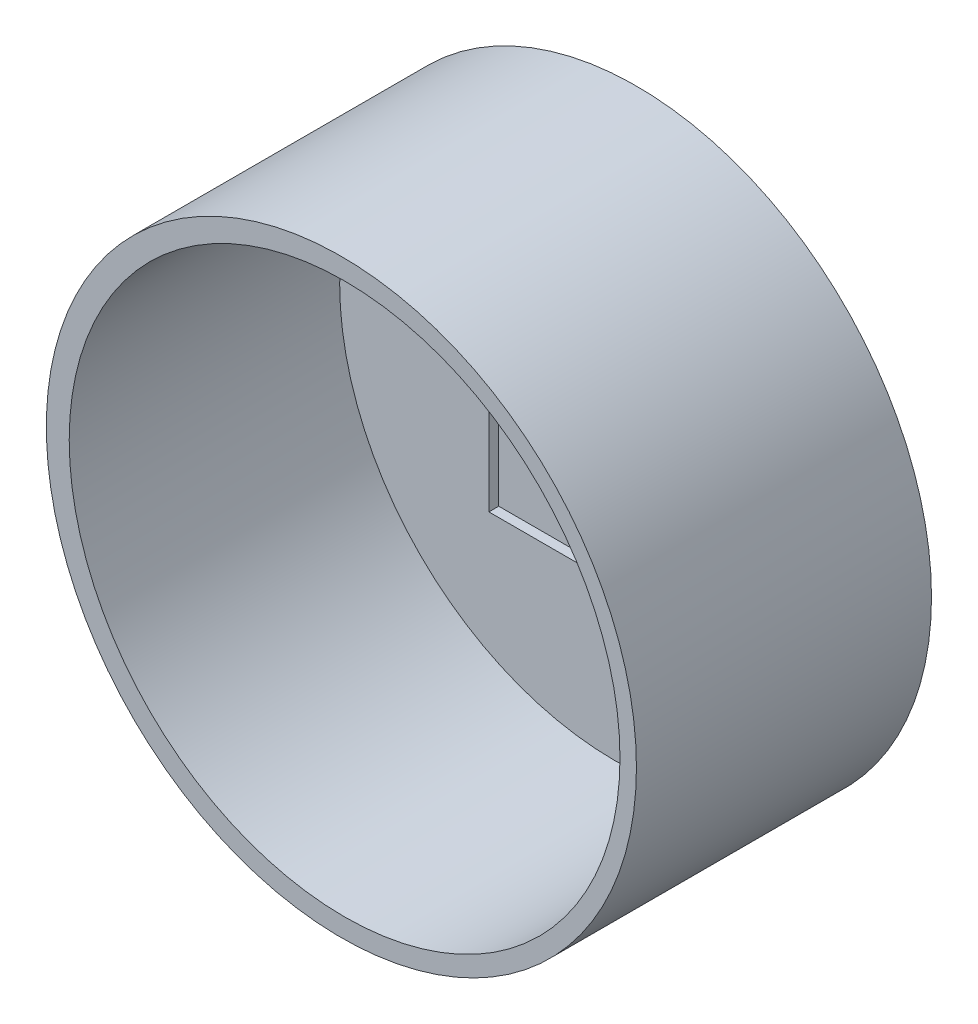
ISO-10303-21;
HEADER;
FILE_DESCRIPTION(('STEP AP214'),'2;1');
FILE_NAME('part.step','',(''),(''),'','','');
FILE_SCHEMA(('AUTOMOTIVE_DESIGN { 1 0 10303 214 1 1 1 1 }'));
ENDSEC;
DATA;
#1=APPLICATION_CONTEXT('core data for automotive mechanical design processes');
#2=APPLICATION_PROTOCOL_DEFINITION('international standard','automotive_design',2000,#1);
#3=PRODUCT_CONTEXT('',#1,'mechanical');
#4=PRODUCT('Part','Part','',(#3));
#5=PRODUCT_RELATED_PRODUCT_CATEGORY('part','',(#4));
#6=PRODUCT_DEFINITION_FORMATION('','',#4);
#7=PRODUCT_DEFINITION_CONTEXT('part definition',#1,'design');
#8=PRODUCT_DEFINITION('design','',#6,#7);
#9=PRODUCT_DEFINITION_SHAPE('','',#8);
#10=(LENGTH_UNIT() NAMED_UNIT(*) SI_UNIT(.MILLI.,.METRE.));
#11=(NAMED_UNIT(*) PLANE_ANGLE_UNIT() SI_UNIT($,.RADIAN.));
#12=(NAMED_UNIT(*) SI_UNIT($,.STERADIAN.) SOLID_ANGLE_UNIT());
#13=UNCERTAINTY_MEASURE_WITH_UNIT(LENGTH_MEASURE(1.E-05),#10,'distance_accuracy_value','');
#14=(GEOMETRIC_REPRESENTATION_CONTEXT(3) GLOBAL_UNCERTAINTY_ASSIGNED_CONTEXT((#13)) GLOBAL_UNIT_ASSIGNED_CONTEXT((#10,
#11,#12)) REPRESENTATION_CONTEXT('',''));
#15=CARTESIAN_POINT('',(0.,0.,0.));
#16=DIRECTION('',(0.,0.,1.));
#17=DIRECTION('',(1.,0.,0.));
#18=AXIS2_PLACEMENT_3D('',#15,#16,#17);
#19=CARTESIAN_POINT('',(0.,0.,76.2));
#20=DIRECTION('',(0.,0.,1.));
#21=DIRECTION('',(1.,0.,0.));
#22=AXIS2_PLACEMENT_3D('',#19,#20,#21);
#23=PLANE('',#22);
#24=CARTESIAN_POINT('',(0.,0.,76.2));
#25=DIRECTION('',(0.,0.,1.));
#26=DIRECTION('',(1.,0.,0.));
#27=AXIS2_PLACEMENT_3D('',#24,#25,#26);
#28=CIRCLE('',#27,76.2);
#29=CARTESIAN_POINT('',(76.2,0.,76.2));
#30=VERTEX_POINT('',#29);
#31=EDGE_CURVE('E50',#30,#30,#28,.T.);
#32=ORIENTED_EDGE('',*,*,#31,.T.);
#33=EDGE_LOOP('',(#32));
#34=FACE_BOUND('',#33,.T.);
#35=CARTESIAN_POINT('',(0.828825482718449,0.,76.2));
#36=DIRECTION('',(0.,0.,1.));
#37=DIRECTION('',(1.,0.,0.));
#38=AXIS2_PLACEMENT_3D('',#35,#36,#37);
#39=CIRCLE('',#38,71.12);
#40=CARTESIAN_POINT('',(71.9488254827184,0.,76.2));
#41=VERTEX_POINT('',#40);
#42=EDGE_CURVE('E117',#41,#41,#39,.T.);
#43=ORIENTED_EDGE('',*,*,#42,.F.);
#44=EDGE_LOOP('',(#43));
#45=FACE_BOUND('',#44,.T.);
#46=ADVANCED_FACE('F42',(#34,#45),#23,.T.);
#47=CARTESIAN_POINT('',(0.,0.,0.));
#48=DIRECTION('',(0.,0.,1.));
#49=DIRECTION('',(1.,0.,0.));
#50=AXIS2_PLACEMENT_3D('',#47,#48,#49);
#51=PLANE('',#50);
#52=CARTESIAN_POINT('',(0.,0.,0.));
#53=DIRECTION('',(0.,0.,1.));
#54=DIRECTION('',(1.,0.,0.));
#55=AXIS2_PLACEMENT_3D('',#52,#53,#54);
#56=CIRCLE('',#55,76.2);
#57=CARTESIAN_POINT('',(76.2,0.,0.));
#58=VERTEX_POINT('',#57);
#59=EDGE_CURVE('E122',#58,#58,#56,.T.);
#60=ORIENTED_EDGE('',*,*,#59,.F.);
#61=EDGE_LOOP('',(#60));
#62=FACE_BOUND('',#61,.T.);
#63=ADVANCED_FACE('F128',(#62),#51,.F.);
#64=CARTESIAN_POINT('',(0.,0.,76.2));
#65=DIRECTION('',(0.,0.,-1.));
#66=DIRECTION('',(-1.,0.,0.));
#67=AXIS2_PLACEMENT_3D('',#64,#65,#66);
#68=CYLINDRICAL_SURFACE('',#67,76.2);
#69=ORIENTED_EDGE('',*,*,#31,.F.);
#70=EDGE_LOOP('',(#69));
#71=FACE_BOUND('',#70,.T.);
#72=ORIENTED_EDGE('',*,*,#59,.T.);
#73=EDGE_LOOP('',(#72));
#74=FACE_BOUND('',#73,.T.);
#75=ADVANCED_FACE('F44',(#71,#74),#68,.T.);
#76=CARTESIAN_POINT('',(0.828825482718449,0.,76.2));
#77=DIRECTION('',(0.,0.,-1.));
#78=DIRECTION('',(-1.,0.,0.));
#79=AXIS2_PLACEMENT_3D('',#76,#77,#78);
#80=CYLINDRICAL_SURFACE('',#79,71.12);
#81=CARTESIAN_POINT('',(0.828825482718449,0.,6.34999999999999));
#82=DIRECTION('',(0.,0.,1.));
#83=DIRECTION('',(1.,0.,0.));
#84=AXIS2_PLACEMENT_3D('',#81,#82,#83);
#85=CIRCLE('',#84,71.12);
#86=CARTESIAN_POINT('',(71.9488254827184,0.,6.34999999999999));
#87=VERTEX_POINT('',#86);
#88=EDGE_CURVE('E11',#87,#87,#85,.T.);
#89=ORIENTED_EDGE('',*,*,#88,.F.);
#90=EDGE_LOOP('',(#89));
#91=FACE_BOUND('',#90,.T.);
#92=ORIENTED_EDGE('',*,*,#42,.T.);
#93=EDGE_LOOP('',(#92));
#94=FACE_BOUND('',#93,.T.);
#95=ADVANCED_FACE('F134',(#91,#94),#80,.F.);
#96=CARTESIAN_POINT('',(0.,0.,6.35));
#97=DIRECTION('',(0.,0.,1.));
#98=DIRECTION('',(1.,0.,0.));
#99=AXIS2_PLACEMENT_3D('',#96,#97,#98);
#100=PLANE('',#99);
#101=DIRECTION('',(0.,-1.,0.));
#102=VECTOR('',#101,1.);
#103=CARTESIAN_POINT('',(-31.75,31.75,6.35));
#104=LINE('',#103,#102);
#105=CARTESIAN_POINT('',(-31.75,31.75,6.35));
#106=VERTEX_POINT('',#105);
#107=CARTESIAN_POINT('',(-31.75,-31.75,6.35));
#108=VERTEX_POINT('',#107);
#109=EDGE_CURVE('E111',#106,#108,#104,.T.);
#110=ORIENTED_EDGE('',*,*,#109,.F.);
#111=DIRECTION('',(-1.,0.,0.));
#112=VECTOR('',#111,1.);
#113=CARTESIAN_POINT('',(-31.75,31.75,6.35));
#114=LINE('',#113,#112);
#115=CARTESIAN_POINT('',(31.75,31.75,6.35));
#116=VERTEX_POINT('',#115);
#117=EDGE_CURVE('E107',#116,#106,#114,.T.);
#118=ORIENTED_EDGE('',*,*,#117,.F.);
#119=DIRECTION('',(0.,1.,0.));
#120=VECTOR('',#119,1.);
#121=CARTESIAN_POINT('',(31.75,31.75,6.35));
#122=LINE('',#121,#120);
#123=CARTESIAN_POINT('',(31.75,-31.75,6.35));
#124=VERTEX_POINT('',#123);
#125=EDGE_CURVE('E57',#124,#116,#122,.T.);
#126=ORIENTED_EDGE('',*,*,#125,.F.);
#127=DIRECTION('',(1.,0.,0.));
#128=VECTOR('',#127,1.);
#129=CARTESIAN_POINT('',(-31.75,-31.75,6.35));
#130=LINE('',#129,#128);
#131=EDGE_CURVE('E94',#108,#124,#130,.T.);
#132=ORIENTED_EDGE('',*,*,#131,.F.);
#133=EDGE_LOOP('',(#110,#118,#126,#132));
#134=FACE_BOUND('',#133,.T.);
#135=ORIENTED_EDGE('',*,*,#88,.T.);
#136=EDGE_LOOP('',(#135));
#137=FACE_BOUND('',#136,.T.);
#138=ADVANCED_FACE('F141',(#134,#137),#100,.T.);
#139=CARTESIAN_POINT('',(-31.75,31.75,3.81));
#140=DIRECTION('',(-1.,0.,0.));
#141=DIRECTION('',(0.,-1.,0.));
#142=AXIS2_PLACEMENT_3D('',#139,#140,#141);
#143=PLANE('',#142);
#144=ORIENTED_EDGE('',*,*,#109,.T.);
#145=DIRECTION('',(0.,0.,1.));
#146=VECTOR('',#145,1.);
#147=CARTESIAN_POINT('',(-31.75,-31.75,3.81));
#148=LINE('',#147,#146);
#149=CARTESIAN_POINT('',(-31.75,-31.75,3.81));
#150=VERTEX_POINT('',#149);
#151=EDGE_CURVE('E82',#150,#108,#148,.T.);
#152=ORIENTED_EDGE('',*,*,#151,.F.);
#153=DIRECTION('',(0.,-1.,0.));
#154=VECTOR('',#153,1.);
#155=CARTESIAN_POINT('',(-31.75,31.75,3.81));
#156=LINE('',#155,#154);
#157=CARTESIAN_POINT('',(-31.75,31.75,3.81));
#158=VERTEX_POINT('',#157);
#159=EDGE_CURVE('E105',#158,#150,#156,.T.);
#160=ORIENTED_EDGE('',*,*,#159,.F.);
#161=DIRECTION('',(0.,0.,1.));
#162=VECTOR('',#161,1.);
#163=CARTESIAN_POINT('',(-31.75,31.75,3.81));
#164=LINE('',#163,#162);
#165=EDGE_CURVE('E66',#158,#106,#164,.T.);
#166=ORIENTED_EDGE('',*,*,#165,.T.);
#167=EDGE_LOOP('',(#144,#152,#160,#166));
#168=FACE_BOUND('',#167,.T.);
#169=ADVANCED_FACE('F145',(#168),#143,.F.);
#170=CARTESIAN_POINT('',(-31.75,31.75,3.81));
#171=DIRECTION('',(0.,1.,0.));
#172=DIRECTION('',(0.,0.,1.));
#173=AXIS2_PLACEMENT_3D('',#170,#171,#172);
#174=PLANE('',#173);
#175=ORIENTED_EDGE('',*,*,#117,.T.);
#176=ORIENTED_EDGE('',*,*,#165,.F.);
#177=DIRECTION('',(-1.,0.,0.));
#178=VECTOR('',#177,1.);
#179=CARTESIAN_POINT('',(-31.75,31.75,3.81));
#180=LINE('',#179,#178);
#181=CARTESIAN_POINT('',(31.75,31.75,3.81));
#182=VERTEX_POINT('',#181);
#183=EDGE_CURVE('E102',#182,#158,#180,.T.);
#184=ORIENTED_EDGE('',*,*,#183,.F.);
#185=DIRECTION('',(0.,0.,1.));
#186=VECTOR('',#185,1.);
#187=CARTESIAN_POINT('',(31.75,31.75,3.81));
#188=LINE('',#187,#186);
#189=EDGE_CURVE('E95',#182,#116,#188,.T.);
#190=ORIENTED_EDGE('',*,*,#189,.T.);
#191=EDGE_LOOP('',(#175,#176,#184,#190));
#192=FACE_BOUND('',#191,.T.);
#193=ADVANCED_FACE('F149',(#192),#174,.F.);
#194=CARTESIAN_POINT('',(31.75,31.75,3.81));
#195=DIRECTION('',(1.,0.,0.));
#196=DIRECTION('',(0.,0.,-1.));
#197=AXIS2_PLACEMENT_3D('',#194,#195,#196);
#198=PLANE('',#197);
#199=ORIENTED_EDGE('',*,*,#125,.T.);
#200=ORIENTED_EDGE('',*,*,#189,.F.);
#201=DIRECTION('',(0.,1.,0.));
#202=VECTOR('',#201,1.);
#203=CARTESIAN_POINT('',(31.75,31.75,3.81));
#204=LINE('',#203,#202);
#205=CARTESIAN_POINT('',(31.75,-31.75,3.81));
#206=VERTEX_POINT('',#205);
#207=EDGE_CURVE('E98',#206,#182,#204,.T.);
#208=ORIENTED_EDGE('',*,*,#207,.F.);
#209=DIRECTION('',(0.,0.,1.));
#210=VECTOR('',#209,1.);
#211=CARTESIAN_POINT('',(31.75,-31.75,3.81));
#212=LINE('',#211,#210);
#213=EDGE_CURVE('E87',#206,#124,#212,.T.);
#214=ORIENTED_EDGE('',*,*,#213,.T.);
#215=EDGE_LOOP('',(#199,#200,#208,#214));
#216=FACE_BOUND('',#215,.T.);
#217=ADVANCED_FACE('F99',(#216),#198,.F.);
#218=CARTESIAN_POINT('',(-31.75,-31.75,3.81));
#219=DIRECTION('',(0.,-1.,0.));
#220=DIRECTION('',(0.,0.,-1.));
#221=AXIS2_PLACEMENT_3D('',#218,#219,#220);
#222=PLANE('',#221);
#223=ORIENTED_EDGE('',*,*,#131,.T.);
#224=ORIENTED_EDGE('',*,*,#213,.F.);
#225=DIRECTION('',(1.,0.,0.));
#226=VECTOR('',#225,1.);
#227=CARTESIAN_POINT('',(-31.75,-31.75,3.81));
#228=LINE('',#227,#226);
#229=EDGE_CURVE('E91',#150,#206,#228,.T.);
#230=ORIENTED_EDGE('',*,*,#229,.F.);
#231=ORIENTED_EDGE('',*,*,#151,.T.);
#232=EDGE_LOOP('',(#223,#224,#230,#231));
#233=FACE_BOUND('',#232,.T.);
#234=ADVANCED_FACE('F89',(#233),#222,.F.);
#235=CARTESIAN_POINT('',(0.,0.,3.81));
#236=DIRECTION('',(0.,0.,1.));
#237=DIRECTION('',(1.,0.,0.));
#238=AXIS2_PLACEMENT_3D('',#235,#236,#237);
#239=PLANE('',#238);
#240=ORIENTED_EDGE('',*,*,#159,.T.);
#241=ORIENTED_EDGE('',*,*,#229,.T.);
#242=ORIENTED_EDGE('',*,*,#207,.T.);
#243=ORIENTED_EDGE('',*,*,#183,.T.);
#244=EDGE_LOOP('',(#240,#241,#242,#243));
#245=FACE_BOUND('',#244,.T.);
#246=ADVANCED_FACE('F104',(#245),#239,.T.);
#247=CLOSED_SHELL('',(#46,#63,#75,#95,#138,#169,#193,#217,#234,#246));
#248=MANIFOLD_SOLID_BREP('B2',#247);
#249=ADVANCED_BREP_SHAPE_REPRESENTATION('',(#18,#248),#14);
#250=SHAPE_DEFINITION_REPRESENTATION(#9,#249);
ENDSEC;
END-ISO-10303-21;
